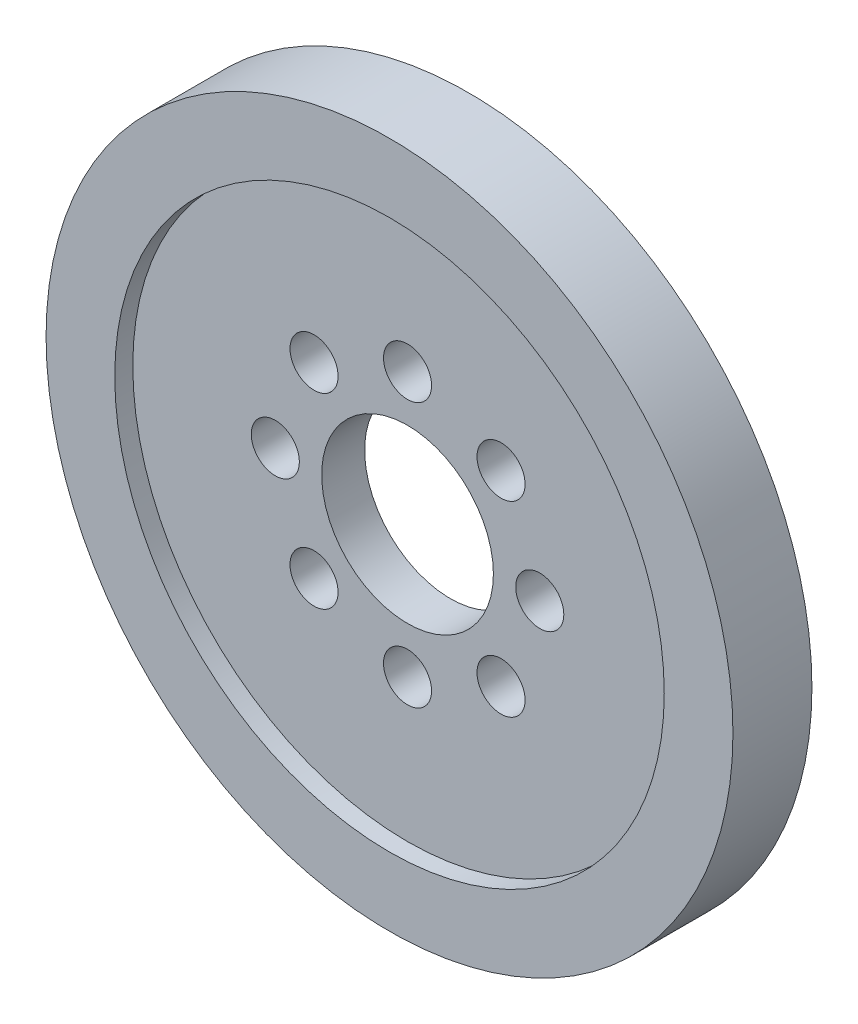
ISO-10303-21;
HEADER;
FILE_DESCRIPTION(('STEP AP214'),'2;1');
FILE_NAME('part.step','',(''),(''),'','','');
FILE_SCHEMA(('AUTOMOTIVE_DESIGN { 1 0 10303 214 1 1 1 1 }'));
ENDSEC;
DATA;
#1=APPLICATION_CONTEXT('core data for automotive mechanical design processes');
#2=APPLICATION_PROTOCOL_DEFINITION('international standard','automotive_design',2000,#1);
#3=PRODUCT_CONTEXT('',#1,'mechanical');
#4=PRODUCT('Part','Part','',(#3));
#5=PRODUCT_RELATED_PRODUCT_CATEGORY('part','',(#4));
#6=PRODUCT_DEFINITION_FORMATION('','',#4);
#7=PRODUCT_DEFINITION_CONTEXT('part definition',#1,'design');
#8=PRODUCT_DEFINITION('design','',#6,#7);
#9=PRODUCT_DEFINITION_SHAPE('','',#8);
#10=(LENGTH_UNIT() NAMED_UNIT(*) SI_UNIT(.MILLI.,.METRE.));
#11=(NAMED_UNIT(*) PLANE_ANGLE_UNIT() SI_UNIT($,.RADIAN.));
#12=(NAMED_UNIT(*) SI_UNIT($,.STERADIAN.) SOLID_ANGLE_UNIT());
#13=UNCERTAINTY_MEASURE_WITH_UNIT(LENGTH_MEASURE(1.E-05),#10,'distance_accuracy_value','');
#14=(GEOMETRIC_REPRESENTATION_CONTEXT(3) GLOBAL_UNCERTAINTY_ASSIGNED_CONTEXT((#13)) GLOBAL_UNIT_ASSIGNED_CONTEXT((#10,
#11,#12)) REPRESENTATION_CONTEXT('',''));
#15=CARTESIAN_POINT('',(0.,0.,0.));
#16=DIRECTION('',(0.,0.,1.));
#17=DIRECTION('',(1.,0.,0.));
#18=AXIS2_PLACEMENT_3D('',#15,#16,#17);
#19=CARTESIAN_POINT('',(0.,0.,2.921));
#20=DIRECTION('',(0.,0.,-1.));
#21=DIRECTION('',(-1.,0.,0.));
#22=AXIS2_PLACEMENT_3D('',#19,#20,#21);
#23=CYLINDRICAL_SURFACE('',#22,20.32);
#24=CARTESIAN_POINT('',(0.,0.,-2.921));
#25=DIRECTION('',(0.,0.,1.));
#26=DIRECTION('',(1.,0.,0.));
#27=AXIS2_PLACEMENT_3D('',#24,#25,#26);
#28=CIRCLE('',#27,20.32);
#29=CARTESIAN_POINT('',(20.32,0.,-2.921));
#30=VERTEX_POINT('',#29);
#31=EDGE_CURVE('E48',#30,#30,#28,.T.);
#32=ORIENTED_EDGE('',*,*,#31,.F.);
#33=EDGE_LOOP('',(#32));
#34=FACE_BOUND('',#33,.T.);
#35=CARTESIAN_POINT('',(0.,0.,-1.5875));
#36=DIRECTION('',(0.,0.,1.));
#37=DIRECTION('',(1.,0.,0.));
#38=AXIS2_PLACEMENT_3D('',#35,#36,#37);
#39=CIRCLE('',#38,20.32);
#40=CARTESIAN_POINT('',(20.32,0.,-1.5875));
#41=VERTEX_POINT('',#40);
#42=EDGE_CURVE('E51',#41,#41,#39,.T.);
#43=ORIENTED_EDGE('',*,*,#42,.T.);
#44=EDGE_LOOP('',(#43));
#45=FACE_BOUND('',#44,.T.);
#46=ADVANCED_FACE('F30',(#34,#45),#23,.F.);
#47=CARTESIAN_POINT('',(0.,0.,2.921));
#48=DIRECTION('',(0.,0.,1.));
#49=DIRECTION('',(1.,0.,0.));
#50=AXIS2_PLACEMENT_3D('',#47,#48,#49);
#51=PLANE('',#50);
#52=CARTESIAN_POINT('',(0.,0.,2.921));
#53=DIRECTION('',(0.,0.,1.));
#54=DIRECTION('',(1.,0.,0.));
#55=AXIS2_PLACEMENT_3D('',#52,#53,#54);
#56=CIRCLE('',#55,25.4);
#57=CARTESIAN_POINT('',(25.4,0.,2.921));
#58=VERTEX_POINT('',#57);
#59=EDGE_CURVE('E37',#58,#58,#56,.T.);
#60=ORIENTED_EDGE('',*,*,#59,.T.);
#61=EDGE_LOOP('',(#60));
#62=FACE_BOUND('',#61,.T.);
#63=CARTESIAN_POINT('',(0.,0.,2.921));
#64=DIRECTION('',(0.,0.,1.));
#65=DIRECTION('',(1.,0.,0.));
#66=AXIS2_PLACEMENT_3D('',#63,#64,#65);
#67=CIRCLE('',#66,20.32);
#68=CARTESIAN_POINT('',(20.32,0.,2.921));
#69=VERTEX_POINT('',#68);
#70=EDGE_CURVE('E46',#69,#69,#67,.T.);
#71=ORIENTED_EDGE('',*,*,#70,.F.);
#72=EDGE_LOOP('',(#71));
#73=FACE_BOUND('',#72,.T.);
#74=ADVANCED_FACE('F133',(#62,#73),#51,.T.);
#75=CARTESIAN_POINT('',(0.,0.,-2.921));
#76=DIRECTION('',(0.,0.,1.));
#77=DIRECTION('',(1.,0.,0.));
#78=AXIS2_PLACEMENT_3D('',#75,#76,#77);
#79=PLANE('',#78);
#80=CARTESIAN_POINT('',(0.,0.,-2.921));
#81=DIRECTION('',(0.,0.,1.));
#82=DIRECTION('',(1.,0.,0.));
#83=AXIS2_PLACEMENT_3D('',#80,#81,#82);
#84=CIRCLE('',#83,25.4);
#85=CARTESIAN_POINT('',(25.4,0.,-2.921));
#86=VERTEX_POINT('',#85);
#87=EDGE_CURVE('E41',#86,#86,#84,.T.);
#88=ORIENTED_EDGE('',*,*,#87,.F.);
#89=EDGE_LOOP('',(#88));
#90=FACE_BOUND('',#89,.T.);
#91=ORIENTED_EDGE('',*,*,#31,.T.);
#92=EDGE_LOOP('',(#91));
#93=FACE_BOUND('',#92,.T.);
#94=ADVANCED_FACE('F138',(#90,#93),#79,.F.);
#95=CARTESIAN_POINT('',(0.,0.,2.921));
#96=DIRECTION('',(0.,0.,-1.));
#97=DIRECTION('',(-1.,0.,0.));
#98=AXIS2_PLACEMENT_3D('',#95,#96,#97);
#99=CYLINDRICAL_SURFACE('',#98,25.4);
#100=ORIENTED_EDGE('',*,*,#59,.F.);
#101=EDGE_LOOP('',(#100));
#102=FACE_BOUND('',#101,.T.);
#103=ORIENTED_EDGE('',*,*,#87,.T.);
#104=EDGE_LOOP('',(#103));
#105=FACE_BOUND('',#104,.T.);
#106=ADVANCED_FACE('F32',(#102,#105),#99,.T.);
#107=CARTESIAN_POINT('',(0.,0.,1.5875));
#108=DIRECTION('',(0.,0.,1.));
#109=DIRECTION('',(1.,0.,0.));
#110=AXIS2_PLACEMENT_3D('',#107,#108,#109);
#111=CIRCLE('',#110,20.32);
#112=CARTESIAN_POINT('',(20.32,0.,1.5875));
#113=VERTEX_POINT('',#112);
#114=EDGE_CURVE('E10',#113,#113,#111,.T.);
#115=ORIENTED_EDGE('',*,*,#114,.F.);
#116=EDGE_LOOP('',(#115));
#117=FACE_BOUND('',#116,.T.);
#118=ORIENTED_EDGE('',*,*,#70,.T.);
#119=EDGE_LOOP('',(#118));
#120=FACE_BOUND('',#119,.T.);
#121=ADVANCED_FACE('F117',(#117,#120),#23,.F.);
#122=CARTESIAN_POINT('',(0.,0.,1.5875));
#123=DIRECTION('',(0.,0.,1.));
#124=DIRECTION('',(1.,0.,0.));
#125=AXIS2_PLACEMENT_3D('',#122,#123,#124);
#126=PLANE('',#125);
#127=CARTESIAN_POINT('',(-9.779,1.02429588037641E-13,1.5875));
#128=DIRECTION('',(0.,0.,1.));
#129=DIRECTION('',(1.,0.,0.));
#130=AXIS2_PLACEMENT_3D('',#127,#128,#129);
#131=CIRCLE('',#130,1.778);
#132=CARTESIAN_POINT('',(-8.001,1.02429588037641E-13,1.5875));
#133=VERTEX_POINT('',#132);
#134=EDGE_CURVE('E96',#133,#133,#131,.T.);
#135=ORIENTED_EDGE('',*,*,#134,.F.);
#136=EDGE_LOOP('',(#135));
#137=FACE_BOUND('',#136,.T.);
#138=CARTESIAN_POINT('',(0.,-9.779,1.5875));
#139=DIRECTION('',(0.,0.,1.));
#140=DIRECTION('',(1.,0.,0.));
#141=AXIS2_PLACEMENT_3D('',#138,#139,#140);
#142=CIRCLE('',#141,1.778);
#143=CARTESIAN_POINT('',(1.77799999999993,-9.779,1.5875));
#144=VERTEX_POINT('',#143);
#145=EDGE_CURVE('E84',#144,#144,#142,.T.);
#146=ORIENTED_EDGE('',*,*,#145,.F.);
#147=EDGE_LOOP('',(#146));
#148=FACE_BOUND('',#147,.T.);
#149=CARTESIAN_POINT('',(9.779,0.,1.5875));
#150=DIRECTION('',(0.,0.,1.));
#151=DIRECTION('',(1.,0.,0.));
#152=AXIS2_PLACEMENT_3D('',#149,#150,#151);
#153=CIRCLE('',#152,1.778);
#154=CARTESIAN_POINT('',(11.557,0.,1.5875));
#155=VERTEX_POINT('',#154);
#156=EDGE_CURVE('E72',#155,#155,#153,.T.);
#157=ORIENTED_EDGE('',*,*,#156,.F.);
#158=EDGE_LOOP('',(#157));
#159=FACE_BOUND('',#158,.T.);
#160=CARTESIAN_POINT('',(0.,9.779,1.5875));
#161=DIRECTION('',(0.,0.,1.));
#162=DIRECTION('',(1.,0.,0.));
#163=AXIS2_PLACEMENT_3D('',#160,#161,#162);
#164=CIRCLE('',#163,1.778);
#165=CARTESIAN_POINT('',(1.778,9.779,1.5875));
#166=VERTEX_POINT('',#165);
#167=EDGE_CURVE('E60',#166,#166,#164,.T.);
#168=ORIENTED_EDGE('',*,*,#167,.F.);
#169=EDGE_LOOP('',(#168));
#170=FACE_BOUND('',#169,.T.);
#171=ORIENTED_EDGE('',*,*,#114,.T.);
#172=EDGE_LOOP('',(#171));
#173=FACE_BOUND('',#172,.T.);
#174=CARTESIAN_POINT('',(0.,0.,1.5875));
#175=DIRECTION('',(0.,0.,1.));
#176=DIRECTION('',(1.,0.,0.));
#177=AXIS2_PLACEMENT_3D('',#174,#175,#176);
#178=CIRCLE('',#177,6.35);
#179=CARTESIAN_POINT('',(6.35,0.,1.5875));
#180=VERTEX_POINT('',#179);
#181=EDGE_CURVE('E56',#180,#180,#178,.T.);
#182=ORIENTED_EDGE('',*,*,#181,.F.);
#183=EDGE_LOOP('',(#182));
#184=FACE_BOUND('',#183,.T.);
#185=CARTESIAN_POINT('',(6.91479721322326,6.91479721322324,1.5875));
#186=DIRECTION('',(0.,0.,1.));
#187=DIRECTION('',(1.,0.,0.));
#188=AXIS2_PLACEMENT_3D('',#185,#186,#187);
#189=CIRCLE('',#188,1.778);
#190=CARTESIAN_POINT('',(8.69279721322326,6.91479721322324,1.5875));
#191=VERTEX_POINT('',#190);
#192=EDGE_CURVE('E66',#191,#191,#189,.T.);
#193=ORIENTED_EDGE('',*,*,#192,.F.);
#194=EDGE_LOOP('',(#193));
#195=FACE_BOUND('',#194,.T.);
#196=CARTESIAN_POINT('',(6.91479721322321,-6.91479721322328,1.5875));
#197=DIRECTION('',(0.,0.,1.));
#198=DIRECTION('',(1.,0.,0.));
#199=AXIS2_PLACEMENT_3D('',#196,#197,#198);
#200=CIRCLE('',#199,1.778);
#201=CARTESIAN_POINT('',(8.69279721322321,-6.91479721322328,1.5875));
#202=VERTEX_POINT('',#201);
#203=EDGE_CURVE('E78',#202,#202,#200,.T.);
#204=ORIENTED_EDGE('',*,*,#203,.F.);
#205=EDGE_LOOP('',(#204));
#206=FACE_BOUND('',#205,.T.);
#207=CARTESIAN_POINT('',(-6.91479721322331,-6.91479721322319,1.5875));
#208=DIRECTION('',(0.,0.,1.));
#209=DIRECTION('',(1.,0.,0.));
#210=AXIS2_PLACEMENT_3D('',#207,#208,#209);
#211=CIRCLE('',#210,1.778);
#212=CARTESIAN_POINT('',(-5.13679721322331,-6.91479721322319,1.5875));
#213=VERTEX_POINT('',#212);
#214=EDGE_CURVE('E90',#213,#213,#211,.T.);
#215=ORIENTED_EDGE('',*,*,#214,.F.);
#216=EDGE_LOOP('',(#215));
#217=FACE_BOUND('',#216,.T.);
#218=CARTESIAN_POINT('',(-6.91479721322316,6.91479721322333,1.5875));
#219=DIRECTION('',(0.,0.,1.));
#220=DIRECTION('',(1.,0.,0.));
#221=AXIS2_PLACEMENT_3D('',#218,#219,#220);
#222=CIRCLE('',#221,1.778);
#223=CARTESIAN_POINT('',(-5.13679721322316,6.91479721322333,1.5875));
#224=VERTEX_POINT('',#223);
#225=EDGE_CURVE('E102',#224,#224,#222,.T.);
#226=ORIENTED_EDGE('',*,*,#225,.F.);
#227=EDGE_LOOP('',(#226));
#228=FACE_BOUND('',#227,.T.);
#229=ADVANCED_FACE('F114',(#137,#148,#159,#170,#173,#184,#195,#206,#217,#228),#126,.T.);
#230=CARTESIAN_POINT('',(0.,0.,-1.5875));
#231=DIRECTION('',(0.,0.,1.));
#232=DIRECTION('',(1.,0.,0.));
#233=AXIS2_PLACEMENT_3D('',#230,#231,#232);
#234=PLANE('',#233);
#235=CARTESIAN_POINT('',(-9.779,1.02429588037641E-13,-1.5875));
#236=DIRECTION('',(0.,0.,1.));
#237=DIRECTION('',(1.,0.,0.));
#238=AXIS2_PLACEMENT_3D('',#235,#236,#237);
#239=CIRCLE('',#238,1.778);
#240=CARTESIAN_POINT('',(-8.001,1.02429588037641E-13,-1.5875));
#241=VERTEX_POINT('',#240);
#242=EDGE_CURVE('E99',#241,#241,#239,.T.);
#243=ORIENTED_EDGE('',*,*,#242,.T.);
#244=EDGE_LOOP('',(#243));
#245=FACE_BOUND('',#244,.T.);
#246=CARTESIAN_POINT('',(0.,-9.779,-1.5875));
#247=DIRECTION('',(0.,0.,1.));
#248=DIRECTION('',(1.,0.,0.));
#249=AXIS2_PLACEMENT_3D('',#246,#247,#248);
#250=CIRCLE('',#249,1.778);
#251=CARTESIAN_POINT('',(1.77799999999993,-9.779,-1.5875));
#252=VERTEX_POINT('',#251);
#253=EDGE_CURVE('E87',#252,#252,#250,.T.);
#254=ORIENTED_EDGE('',*,*,#253,.T.);
#255=EDGE_LOOP('',(#254));
#256=FACE_BOUND('',#255,.T.);
#257=CARTESIAN_POINT('',(9.779,0.,-1.5875));
#258=DIRECTION('',(0.,0.,1.));
#259=DIRECTION('',(1.,0.,0.));
#260=AXIS2_PLACEMENT_3D('',#257,#258,#259);
#261=CIRCLE('',#260,1.778);
#262=CARTESIAN_POINT('',(11.557,0.,-1.5875));
#263=VERTEX_POINT('',#262);
#264=EDGE_CURVE('E75',#263,#263,#261,.T.);
#265=ORIENTED_EDGE('',*,*,#264,.T.);
#266=EDGE_LOOP('',(#265));
#267=FACE_BOUND('',#266,.T.);
#268=CARTESIAN_POINT('',(0.,9.779,-1.5875));
#269=DIRECTION('',(0.,0.,1.));
#270=DIRECTION('',(1.,0.,0.));
#271=AXIS2_PLACEMENT_3D('',#268,#269,#270);
#272=CIRCLE('',#271,1.778);
#273=CARTESIAN_POINT('',(1.778,9.779,-1.5875));
#274=VERTEX_POINT('',#273);
#275=EDGE_CURVE('E63',#274,#274,#272,.T.);
#276=ORIENTED_EDGE('',*,*,#275,.T.);
#277=EDGE_LOOP('',(#276));
#278=FACE_BOUND('',#277,.T.);
#279=ORIENTED_EDGE('',*,*,#42,.F.);
#280=EDGE_LOOP('',(#279));
#281=FACE_BOUND('',#280,.T.);
#282=CARTESIAN_POINT('',(0.,0.,-1.5875));
#283=DIRECTION('',(0.,0.,1.));
#284=DIRECTION('',(1.,0.,0.));
#285=AXIS2_PLACEMENT_3D('',#282,#283,#284);
#286=CIRCLE('',#285,6.35);
#287=CARTESIAN_POINT('',(6.35,0.,-1.5875));
#288=VERTEX_POINT('',#287);
#289=EDGE_CURVE('E57',#288,#288,#286,.T.);
#290=ORIENTED_EDGE('',*,*,#289,.T.);
#291=EDGE_LOOP('',(#290));
#292=FACE_BOUND('',#291,.T.);
#293=CARTESIAN_POINT('',(6.91479721322326,6.91479721322324,-1.5875));
#294=DIRECTION('',(0.,0.,1.));
#295=DIRECTION('',(1.,0.,0.));
#296=AXIS2_PLACEMENT_3D('',#293,#294,#295);
#297=CIRCLE('',#296,1.778);
#298=CARTESIAN_POINT('',(8.69279721322326,6.91479721322324,-1.5875));
#299=VERTEX_POINT('',#298);
#300=EDGE_CURVE('E69',#299,#299,#297,.T.);
#301=ORIENTED_EDGE('',*,*,#300,.T.);
#302=EDGE_LOOP('',(#301));
#303=FACE_BOUND('',#302,.T.);
#304=CARTESIAN_POINT('',(6.91479721322321,-6.91479721322328,-1.5875));
#305=DIRECTION('',(0.,0.,1.));
#306=DIRECTION('',(1.,0.,0.));
#307=AXIS2_PLACEMENT_3D('',#304,#305,#306);
#308=CIRCLE('',#307,1.778);
#309=CARTESIAN_POINT('',(8.69279721322321,-6.91479721322328,-1.5875));
#310=VERTEX_POINT('',#309);
#311=EDGE_CURVE('E81',#310,#310,#308,.T.);
#312=ORIENTED_EDGE('',*,*,#311,.T.);
#313=EDGE_LOOP('',(#312));
#314=FACE_BOUND('',#313,.T.);
#315=CARTESIAN_POINT('',(-6.91479721322331,-6.91479721322319,-1.5875));
#316=DIRECTION('',(0.,0.,1.));
#317=DIRECTION('',(1.,0.,0.));
#318=AXIS2_PLACEMENT_3D('',#315,#316,#317);
#319=CIRCLE('',#318,1.778);
#320=CARTESIAN_POINT('',(-5.13679721322331,-6.91479721322319,-1.5875));
#321=VERTEX_POINT('',#320);
#322=EDGE_CURVE('E93',#321,#321,#319,.T.);
#323=ORIENTED_EDGE('',*,*,#322,.T.);
#324=EDGE_LOOP('',(#323));
#325=FACE_BOUND('',#324,.T.);
#326=CARTESIAN_POINT('',(-6.91479721322316,6.91479721322333,-1.5875));
#327=DIRECTION('',(0.,0.,1.));
#328=DIRECTION('',(1.,0.,0.));
#329=AXIS2_PLACEMENT_3D('',#326,#327,#328);
#330=CIRCLE('',#329,1.778);
#331=CARTESIAN_POINT('',(-5.13679721322316,6.91479721322333,-1.5875));
#332=VERTEX_POINT('',#331);
#333=EDGE_CURVE('E105',#332,#332,#330,.T.);
#334=ORIENTED_EDGE('',*,*,#333,.T.);
#335=EDGE_LOOP('',(#334));
#336=FACE_BOUND('',#335,.T.);
#337=ADVANCED_FACE('F116',(#245,#256,#267,#278,#281,#292,#303,#314,#325,#336),#234,.F.);
#338=CARTESIAN_POINT('',(0.,0.,1.5875));
#339=DIRECTION('',(0.,0.,-1.));
#340=DIRECTION('',(-1.,0.,0.));
#341=AXIS2_PLACEMENT_3D('',#338,#339,#340);
#342=CYLINDRICAL_SURFACE('',#341,6.35);
#343=ORIENTED_EDGE('',*,*,#181,.T.);
#344=EDGE_LOOP('',(#343));
#345=FACE_BOUND('',#344,.T.);
#346=ORIENTED_EDGE('',*,*,#289,.F.);
#347=EDGE_LOOP('',(#346));
#348=FACE_BOUND('',#347,.T.);
#349=ADVANCED_FACE('F124',(#345,#348),#342,.F.);
#350=CARTESIAN_POINT('',(0.,9.779,1.5875));
#351=DIRECTION('',(0.,0.,-1.));
#352=DIRECTION('',(-1.,0.,0.));
#353=AXIS2_PLACEMENT_3D('',#350,#351,#352);
#354=CYLINDRICAL_SURFACE('',#353,1.778);
#355=ORIENTED_EDGE('',*,*,#167,.T.);
#356=EDGE_LOOP('',(#355));
#357=FACE_BOUND('',#356,.T.);
#358=ORIENTED_EDGE('',*,*,#275,.F.);
#359=EDGE_LOOP('',(#358));
#360=FACE_BOUND('',#359,.T.);
#361=ADVANCED_FACE('F178',(#357,#360),#354,.F.);
#362=CARTESIAN_POINT('',(6.91479721322326,6.91479721322324,1.5875));
#363=DIRECTION('',(0.,0.,-1.));
#364=DIRECTION('',(-1.,0.,0.));
#365=AXIS2_PLACEMENT_3D('',#362,#363,#364);
#366=CYLINDRICAL_SURFACE('',#365,1.778);
#367=ORIENTED_EDGE('',*,*,#192,.T.);
#368=EDGE_LOOP('',(#367));
#369=FACE_BOUND('',#368,.T.);
#370=ORIENTED_EDGE('',*,*,#300,.F.);
#371=EDGE_LOOP('',(#370));
#372=FACE_BOUND('',#371,.T.);
#373=ADVANCED_FACE('F187',(#369,#372),#366,.F.);
#374=CARTESIAN_POINT('',(9.779,0.,1.5875));
#375=DIRECTION('',(0.,0.,-1.));
#376=DIRECTION('',(-1.,0.,0.));
#377=AXIS2_PLACEMENT_3D('',#374,#375,#376);
#378=CYLINDRICAL_SURFACE('',#377,1.778);
#379=ORIENTED_EDGE('',*,*,#156,.T.);
#380=EDGE_LOOP('',(#379));
#381=FACE_BOUND('',#380,.T.);
#382=ORIENTED_EDGE('',*,*,#264,.F.);
#383=EDGE_LOOP('',(#382));
#384=FACE_BOUND('',#383,.T.);
#385=ADVANCED_FACE('F197',(#381,#384),#378,.F.);
#386=CARTESIAN_POINT('',(6.91479721322321,-6.91479721322328,1.5875));
#387=DIRECTION('',(0.,0.,-1.));
#388=DIRECTION('',(-1.,0.,0.));
#389=AXIS2_PLACEMENT_3D('',#386,#387,#388);
#390=CYLINDRICAL_SURFACE('',#389,1.778);
#391=ORIENTED_EDGE('',*,*,#203,.T.);
#392=EDGE_LOOP('',(#391));
#393=FACE_BOUND('',#392,.T.);
#394=ORIENTED_EDGE('',*,*,#311,.F.);
#395=EDGE_LOOP('',(#394));
#396=FACE_BOUND('',#395,.T.);
#397=ADVANCED_FACE('F207',(#393,#396),#390,.F.);
#398=CARTESIAN_POINT('',(0.,-9.779,1.5875));
#399=DIRECTION('',(0.,0.,-1.));
#400=DIRECTION('',(-1.,0.,0.));
#401=AXIS2_PLACEMENT_3D('',#398,#399,#400);
#402=CYLINDRICAL_SURFACE('',#401,1.778);
#403=ORIENTED_EDGE('',*,*,#145,.T.);
#404=EDGE_LOOP('',(#403));
#405=FACE_BOUND('',#404,.T.);
#406=ORIENTED_EDGE('',*,*,#253,.F.);
#407=EDGE_LOOP('',(#406));
#408=FACE_BOUND('',#407,.T.);
#409=ADVANCED_FACE('F217',(#405,#408),#402,.F.);
#410=CARTESIAN_POINT('',(-6.91479721322331,-6.91479721322319,1.5875));
#411=DIRECTION('',(0.,0.,-1.));
#412=DIRECTION('',(-1.,0.,0.));
#413=AXIS2_PLACEMENT_3D('',#410,#411,#412);
#414=CYLINDRICAL_SURFACE('',#413,1.778);
#415=ORIENTED_EDGE('',*,*,#214,.T.);
#416=EDGE_LOOP('',(#415));
#417=FACE_BOUND('',#416,.T.);
#418=ORIENTED_EDGE('',*,*,#322,.F.);
#419=EDGE_LOOP('',(#418));
#420=FACE_BOUND('',#419,.T.);
#421=ADVANCED_FACE('F227',(#417,#420),#414,.F.);
#422=CARTESIAN_POINT('',(-9.779,1.02429588037641E-13,1.5875));
#423=DIRECTION('',(0.,0.,-1.));
#424=DIRECTION('',(-1.,0.,0.));
#425=AXIS2_PLACEMENT_3D('',#422,#423,#424);
#426=CYLINDRICAL_SURFACE('',#425,1.778);
#427=ORIENTED_EDGE('',*,*,#134,.T.);
#428=EDGE_LOOP('',(#427));
#429=FACE_BOUND('',#428,.T.);
#430=ORIENTED_EDGE('',*,*,#242,.F.);
#431=EDGE_LOOP('',(#430));
#432=FACE_BOUND('',#431,.T.);
#433=ADVANCED_FACE('F237',(#429,#432),#426,.F.);
#434=CARTESIAN_POINT('',(-6.91479721322316,6.91479721322333,1.5875));
#435=DIRECTION('',(0.,0.,-1.));
#436=DIRECTION('',(-1.,0.,0.));
#437=AXIS2_PLACEMENT_3D('',#434,#435,#436);
#438=CYLINDRICAL_SURFACE('',#437,1.778);
#439=ORIENTED_EDGE('',*,*,#225,.T.);
#440=EDGE_LOOP('',(#439));
#441=FACE_BOUND('',#440,.T.);
#442=ORIENTED_EDGE('',*,*,#333,.F.);
#443=EDGE_LOOP('',(#442));
#444=FACE_BOUND('',#443,.T.);
#445=ADVANCED_FACE('F111',(#441,#444),#438,.F.);
#446=CLOSED_SHELL('',(#46,#74,#94,#106,#121,#229,#337,#349,#361,#373,#385,#397,#409,#421,#433,#445));
#447=MANIFOLD_SOLID_BREP('B2',#446);
#448=ADVANCED_BREP_SHAPE_REPRESENTATION('',(#18,#447),#14);
#449=SHAPE_DEFINITION_REPRESENTATION(#9,#448);
ENDSEC;
END-ISO-10303-21;
